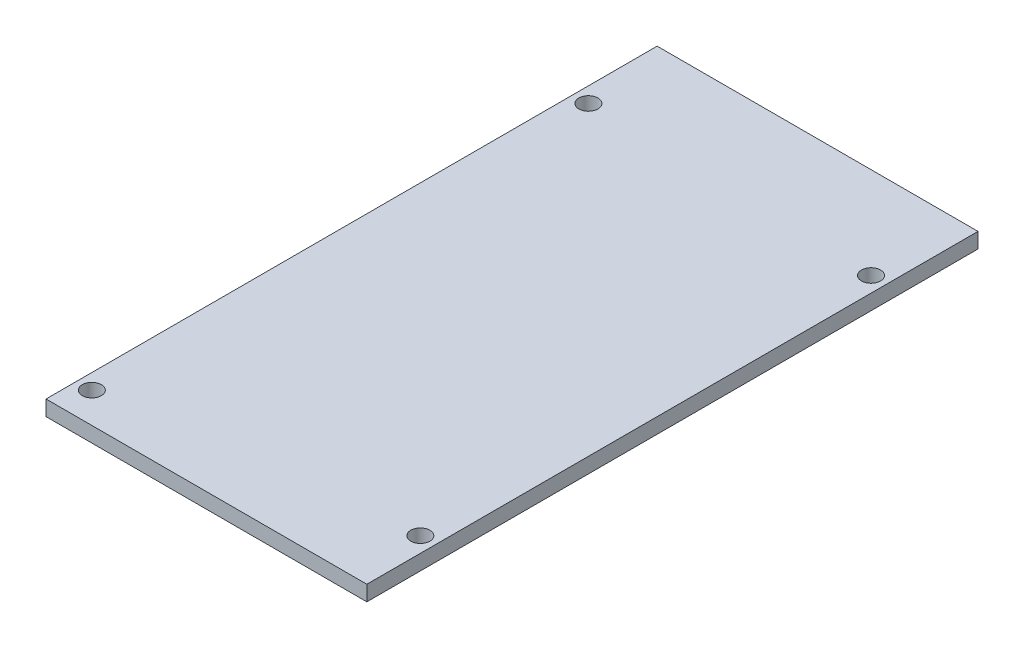
ISO-10303-21;
HEADER;
FILE_DESCRIPTION(('STEP AP214'),'2;1');
FILE_NAME('part.step','',(''),(''),'','','');
FILE_SCHEMA(('AUTOMOTIVE_DESIGN { 1 0 10303 214 1 1 1 1 }'));
ENDSEC;
DATA;
#1=APPLICATION_CONTEXT('core data for automotive mechanical design processes');
#2=APPLICATION_PROTOCOL_DEFINITION('international standard','automotive_design',2000,#1);
#3=PRODUCT_CONTEXT('',#1,'mechanical');
#4=PRODUCT('Part','Part','',(#3));
#5=PRODUCT_RELATED_PRODUCT_CATEGORY('part','',(#4));
#6=PRODUCT_DEFINITION_FORMATION('','',#4);
#7=PRODUCT_DEFINITION_CONTEXT('part definition',#1,'design');
#8=PRODUCT_DEFINITION('design','',#6,#7);
#9=PRODUCT_DEFINITION_SHAPE('','',#8);
#10=(LENGTH_UNIT() NAMED_UNIT(*) SI_UNIT(.MILLI.,.METRE.));
#11=(NAMED_UNIT(*) PLANE_ANGLE_UNIT() SI_UNIT($,.RADIAN.));
#12=(NAMED_UNIT(*) SI_UNIT($,.STERADIAN.) SOLID_ANGLE_UNIT());
#13=UNCERTAINTY_MEASURE_WITH_UNIT(LENGTH_MEASURE(1.E-05),#10,'distance_accuracy_value','');
#14=(GEOMETRIC_REPRESENTATION_CONTEXT(3) GLOBAL_UNCERTAINTY_ASSIGNED_CONTEXT((#13)) GLOBAL_UNIT_ASSIGNED_CONTEXT((#10,
#11,#12)) REPRESENTATION_CONTEXT('',''));
#15=CARTESIAN_POINT('',(0.,0.,0.));
#16=DIRECTION('',(0.,0.,1.));
#17=DIRECTION('',(1.,0.,0.));
#18=AXIS2_PLACEMENT_3D('',#15,#16,#17);
#19=CARTESIAN_POINT('',(0.,2.54,0.));
#20=DIRECTION('',(0.,-1.,0.));
#21=DIRECTION('',(0.,0.,-1.));
#22=AXIS2_PLACEMENT_3D('',#19,#20,#21);
#23=PLANE('',#22);
#24=DIRECTION('',(0.,0.,1.));
#25=VECTOR('',#24,1.);
#26=CARTESIAN_POINT('',(0.,2.54,0.));
#27=LINE('',#26,#25);
#28=CARTESIAN_POINT('',(0.,2.54,-101.6));
#29=VERTEX_POINT('',#28);
#30=CARTESIAN_POINT('',(0.,2.54,0.));
#31=VERTEX_POINT('',#30);
#32=EDGE_CURVE('E85',#29,#31,#27,.T.);
#33=ORIENTED_EDGE('',*,*,#32,.T.);
#34=DIRECTION('',(1.,0.,0.));
#35=VECTOR('',#34,1.);
#36=CARTESIAN_POINT('',(0.,2.54,0.));
#37=LINE('',#36,#35);
#38=CARTESIAN_POINT('',(53.34,2.54,0.));
#39=VERTEX_POINT('',#38);
#40=EDGE_CURVE('E80',#31,#39,#37,.T.);
#41=ORIENTED_EDGE('',*,*,#40,.T.);
#42=DIRECTION('',(0.,0.,-1.));
#43=VECTOR('',#42,1.);
#44=CARTESIAN_POINT('',(53.34,2.54,0.));
#45=LINE('',#44,#43);
#46=CARTESIAN_POINT('',(53.34,2.54,-101.6));
#47=VERTEX_POINT('',#46);
#48=EDGE_CURVE('E83',#39,#47,#45,.T.);
#49=ORIENTED_EDGE('',*,*,#48,.T.);
#50=DIRECTION('',(-1.,0.,0.));
#51=VECTOR('',#50,1.);
#52=CARTESIAN_POINT('',(0.,2.54,-101.6));
#53=LINE('',#52,#51);
#54=EDGE_CURVE('E50',#47,#29,#53,.T.);
#55=ORIENTED_EDGE('',*,*,#54,.T.);
#56=EDGE_LOOP('',(#33,#41,#49,#55));
#57=FACE_BOUND('',#56,.T.);
#58=CARTESIAN_POINT('',(50.8,2.54,-86.36));
#59=DIRECTION('',(0.,1.,0.));
#60=DIRECTION('',(0.,0.,1.));
#61=AXIS2_PLACEMENT_3D('',#58,#59,#60);
#62=CIRCLE('',#61,1.5875);
#63=CARTESIAN_POINT('',(50.8,2.54,-84.7725));
#64=VERTEX_POINT('',#63);
#65=EDGE_CURVE('E100',#64,#64,#62,.T.);
#66=ORIENTED_EDGE('',*,*,#65,.F.);
#67=EDGE_LOOP('',(#66));
#68=FACE_BOUND('',#67,.T.);
#69=CARTESIAN_POINT('',(2.54,2.54,-87.63));
#70=DIRECTION('',(0.,1.,0.));
#71=DIRECTION('',(0.,0.,1.));
#72=AXIS2_PLACEMENT_3D('',#69,#70,#71);
#73=CIRCLE('',#72,1.5875);
#74=CARTESIAN_POINT('',(2.54,2.54,-86.0425));
#75=VERTEX_POINT('',#74);
#76=EDGE_CURVE('E115',#75,#75,#73,.T.);
#77=ORIENTED_EDGE('',*,*,#76,.F.);
#78=EDGE_LOOP('',(#77));
#79=FACE_BOUND('',#78,.T.);
#80=CARTESIAN_POINT('',(2.54,2.54,-5.08));
#81=DIRECTION('',(0.,1.,0.));
#82=DIRECTION('',(0.,0.,1.));
#83=AXIS2_PLACEMENT_3D('',#80,#81,#82);
#84=CIRCLE('',#83,1.5875);
#85=CARTESIAN_POINT('',(2.54,2.54,-3.4925));
#86=VERTEX_POINT('',#85);
#87=EDGE_CURVE('E121',#86,#86,#84,.T.);
#88=ORIENTED_EDGE('',*,*,#87,.F.);
#89=EDGE_LOOP('',(#88));
#90=FACE_BOUND('',#89,.T.);
#91=CARTESIAN_POINT('',(50.8,2.54,-11.43));
#92=DIRECTION('',(0.,1.,0.));
#93=DIRECTION('',(0.,0.,1.));
#94=AXIS2_PLACEMENT_3D('',#91,#92,#93);
#95=CIRCLE('',#94,1.5875);
#96=CARTESIAN_POINT('',(50.8,2.54,-9.84250000000001));
#97=VERTEX_POINT('',#96);
#98=EDGE_CURVE('E127',#97,#97,#95,.T.);
#99=ORIENTED_EDGE('',*,*,#98,.F.);
#100=EDGE_LOOP('',(#99));
#101=FACE_BOUND('',#100,.T.);
#102=ADVANCED_FACE('F33',(#57,#68,#79,#90,#101),#23,.F.);
#103=CARTESIAN_POINT('',(0.,0.,0.));
#104=DIRECTION('',(0.,-1.,0.));
#105=DIRECTION('',(0.,0.,-1.));
#106=AXIS2_PLACEMENT_3D('',#103,#104,#105);
#107=PLANE('',#106);
#108=CARTESIAN_POINT('',(2.54,0.,-5.08));
#109=DIRECTION('',(0.,1.,0.));
#110=DIRECTION('',(0.,0.,1.));
#111=AXIS2_PLACEMENT_3D('',#108,#109,#110);
#112=CIRCLE('',#111,1.5875);
#113=CARTESIAN_POINT('',(2.54,0.,-3.4925));
#114=VERTEX_POINT('',#113);
#115=EDGE_CURVE('E124',#114,#114,#112,.T.);
#116=ORIENTED_EDGE('',*,*,#115,.T.);
#117=EDGE_LOOP('',(#116));
#118=FACE_BOUND('',#117,.T.);
#119=CARTESIAN_POINT('',(50.8,0.,-86.36));
#120=DIRECTION('',(0.,1.,0.));
#121=DIRECTION('',(0.,0.,1.));
#122=AXIS2_PLACEMENT_3D('',#119,#120,#121);
#123=CIRCLE('',#122,1.5875);
#124=CARTESIAN_POINT('',(50.8,0.,-84.7725));
#125=VERTEX_POINT('',#124);
#126=EDGE_CURVE('E112',#125,#125,#123,.T.);
#127=ORIENTED_EDGE('',*,*,#126,.T.);
#128=EDGE_LOOP('',(#127));
#129=FACE_BOUND('',#128,.T.);
#130=DIRECTION('',(0.,0.,1.));
#131=VECTOR('',#130,1.);
#132=CARTESIAN_POINT('',(0.,0.,0.));
#133=LINE('',#132,#131);
#134=CARTESIAN_POINT('',(0.,0.,-101.6));
#135=VERTEX_POINT('',#134);
#136=CARTESIAN_POINT('',(0.,0.,0.));
#137=VERTEX_POINT('',#136);
#138=EDGE_CURVE('E97',#135,#137,#133,.T.);
#139=ORIENTED_EDGE('',*,*,#138,.F.);
#140=DIRECTION('',(-1.,0.,0.));
#141=VECTOR('',#140,1.);
#142=CARTESIAN_POINT('',(0.,0.,-101.6));
#143=LINE('',#142,#141);
#144=CARTESIAN_POINT('',(53.34,0.,-101.6));
#145=VERTEX_POINT('',#144);
#146=EDGE_CURVE('E73',#145,#135,#143,.T.);
#147=ORIENTED_EDGE('',*,*,#146,.F.);
#148=DIRECTION('',(0.,0.,-1.));
#149=VECTOR('',#148,1.);
#150=CARTESIAN_POINT('',(53.34,0.,0.));
#151=LINE('',#150,#149);
#152=CARTESIAN_POINT('',(53.34,0.,0.));
#153=VERTEX_POINT('',#152);
#154=EDGE_CURVE('E67',#153,#145,#151,.T.);
#155=ORIENTED_EDGE('',*,*,#154,.F.);
#156=DIRECTION('',(1.,0.,0.));
#157=VECTOR('',#156,1.);
#158=CARTESIAN_POINT('',(0.,0.,0.));
#159=LINE('',#158,#157);
#160=EDGE_CURVE('E89',#137,#153,#159,.T.);
#161=ORIENTED_EDGE('',*,*,#160,.F.);
#162=EDGE_LOOP('',(#139,#147,#155,#161));
#163=FACE_BOUND('',#162,.T.);
#164=CARTESIAN_POINT('',(2.54,0.,-87.63));
#165=DIRECTION('',(0.,1.,0.));
#166=DIRECTION('',(0.,0.,1.));
#167=AXIS2_PLACEMENT_3D('',#164,#165,#166);
#168=CIRCLE('',#167,1.5875);
#169=CARTESIAN_POINT('',(2.54,0.,-86.0425));
#170=VERTEX_POINT('',#169);
#171=EDGE_CURVE('E118',#170,#170,#168,.T.);
#172=ORIENTED_EDGE('',*,*,#171,.T.);
#173=EDGE_LOOP('',(#172));
#174=FACE_BOUND('',#173,.T.);
#175=CARTESIAN_POINT('',(50.8,0.,-11.43));
#176=DIRECTION('',(0.,1.,0.));
#177=DIRECTION('',(0.,0.,1.));
#178=AXIS2_PLACEMENT_3D('',#175,#176,#177);
#179=CIRCLE('',#178,1.5875);
#180=CARTESIAN_POINT('',(50.8,0.,-9.84250000000001));
#181=VERTEX_POINT('',#180);
#182=EDGE_CURVE('E130',#181,#181,#179,.T.);
#183=ORIENTED_EDGE('',*,*,#182,.T.);
#184=EDGE_LOOP('',(#183));
#185=FACE_BOUND('',#184,.T.);
#186=ADVANCED_FACE('F108',(#118,#129,#163,#174,#185),#107,.T.);
#187=CARTESIAN_POINT('',(0.,2.54,0.));
#188=DIRECTION('',(1.,0.,0.));
#189=DIRECTION('',(0.,0.,-1.));
#190=AXIS2_PLACEMENT_3D('',#187,#188,#189);
#191=PLANE('',#190);
#192=ORIENTED_EDGE('',*,*,#138,.T.);
#193=DIRECTION('',(0.,-1.,0.));
#194=VECTOR('',#193,1.);
#195=CARTESIAN_POINT('',(0.,2.54,0.));
#196=LINE('',#195,#194);
#197=EDGE_CURVE('E11',#31,#137,#196,.T.);
#198=ORIENTED_EDGE('',*,*,#197,.F.);
#199=ORIENTED_EDGE('',*,*,#32,.F.);
#200=DIRECTION('',(0.,-1.,0.));
#201=VECTOR('',#200,1.);
#202=CARTESIAN_POINT('',(0.,2.54,-101.6));
#203=LINE('',#202,#201);
#204=EDGE_CURVE('E93',#29,#135,#203,.T.);
#205=ORIENTED_EDGE('',*,*,#204,.T.);
#206=EDGE_LOOP('',(#192,#198,#199,#205));
#207=FACE_BOUND('',#206,.T.);
#208=ADVANCED_FACE('F35',(#207),#191,.F.);
#209=CARTESIAN_POINT('',(0.,2.54,0.));
#210=DIRECTION('',(0.,0.,-1.));
#211=DIRECTION('',(-1.,0.,0.));
#212=AXIS2_PLACEMENT_3D('',#209,#210,#211);
#213=PLANE('',#212);
#214=ORIENTED_EDGE('',*,*,#160,.T.);
#215=DIRECTION('',(0.,-1.,0.));
#216=VECTOR('',#215,1.);
#217=CARTESIAN_POINT('',(53.34,2.54,0.));
#218=LINE('',#217,#216);
#219=EDGE_CURVE('E42',#39,#153,#218,.T.);
#220=ORIENTED_EDGE('',*,*,#219,.F.);
#221=ORIENTED_EDGE('',*,*,#40,.F.);
#222=ORIENTED_EDGE('',*,*,#197,.T.);
#223=EDGE_LOOP('',(#214,#220,#221,#222));
#224=FACE_BOUND('',#223,.T.);
#225=ADVANCED_FACE('F88',(#224),#213,.F.);
#226=CARTESIAN_POINT('',(53.34,2.54,0.));
#227=DIRECTION('',(-1.,0.,0.));
#228=DIRECTION('',(0.,0.,1.));
#229=AXIS2_PLACEMENT_3D('',#226,#227,#228);
#230=PLANE('',#229);
#231=ORIENTED_EDGE('',*,*,#154,.T.);
#232=DIRECTION('',(0.,-1.,0.));
#233=VECTOR('',#232,1.);
#234=CARTESIAN_POINT('',(53.34,2.54,-101.6));
#235=LINE('',#234,#233);
#236=EDGE_CURVE('E90',#47,#145,#235,.T.);
#237=ORIENTED_EDGE('',*,*,#236,.F.);
#238=ORIENTED_EDGE('',*,*,#48,.F.);
#239=ORIENTED_EDGE('',*,*,#219,.T.);
#240=EDGE_LOOP('',(#231,#237,#238,#239));
#241=FACE_BOUND('',#240,.T.);
#242=ADVANCED_FACE('F91',(#241),#230,.F.);
#243=CARTESIAN_POINT('',(0.,2.54,-101.6));
#244=DIRECTION('',(0.,0.,1.));
#245=DIRECTION('',(1.,0.,0.));
#246=AXIS2_PLACEMENT_3D('',#243,#244,#245);
#247=PLANE('',#246);
#248=ORIENTED_EDGE('',*,*,#146,.T.);
#249=ORIENTED_EDGE('',*,*,#204,.F.);
#250=ORIENTED_EDGE('',*,*,#54,.F.);
#251=ORIENTED_EDGE('',*,*,#236,.T.);
#252=EDGE_LOOP('',(#248,#249,#250,#251));
#253=FACE_BOUND('',#252,.T.);
#254=ADVANCED_FACE('F105',(#253),#247,.F.);
#255=CARTESIAN_POINT('',(50.8,2.54,-86.36));
#256=DIRECTION('',(0.,-1.,0.));
#257=DIRECTION('',(0.,0.,-1.));
#258=AXIS2_PLACEMENT_3D('',#255,#256,#257);
#259=CYLINDRICAL_SURFACE('',#258,1.5875);
#260=ORIENTED_EDGE('',*,*,#65,.T.);
#261=EDGE_LOOP('',(#260));
#262=FACE_BOUND('',#261,.T.);
#263=ORIENTED_EDGE('',*,*,#126,.F.);
#264=EDGE_LOOP('',(#263));
#265=FACE_BOUND('',#264,.T.);
#266=ADVANCED_FACE('F147',(#262,#265),#259,.F.);
#267=CARTESIAN_POINT('',(2.54,2.54,-87.63));
#268=DIRECTION('',(0.,-1.,0.));
#269=DIRECTION('',(0.,0.,-1.));
#270=AXIS2_PLACEMENT_3D('',#267,#268,#269);
#271=CYLINDRICAL_SURFACE('',#270,1.5875);
#272=ORIENTED_EDGE('',*,*,#76,.T.);
#273=EDGE_LOOP('',(#272));
#274=FACE_BOUND('',#273,.T.);
#275=ORIENTED_EDGE('',*,*,#171,.F.);
#276=EDGE_LOOP('',(#275));
#277=FACE_BOUND('',#276,.T.);
#278=ADVANCED_FACE('F193',(#274,#277),#271,.F.);
#279=CARTESIAN_POINT('',(2.54,2.54,-5.08));
#280=DIRECTION('',(0.,-1.,0.));
#281=DIRECTION('',(0.,0.,-1.));
#282=AXIS2_PLACEMENT_3D('',#279,#280,#281);
#283=CYLINDRICAL_SURFACE('',#282,1.5875);
#284=ORIENTED_EDGE('',*,*,#87,.T.);
#285=EDGE_LOOP('',(#284));
#286=FACE_BOUND('',#285,.T.);
#287=ORIENTED_EDGE('',*,*,#115,.F.);
#288=EDGE_LOOP('',(#287));
#289=FACE_BOUND('',#288,.T.);
#290=ADVANCED_FACE('F201',(#286,#289),#283,.F.);
#291=CARTESIAN_POINT('',(50.8,2.54,-11.43));
#292=DIRECTION('',(0.,-1.,0.));
#293=DIRECTION('',(0.,0.,-1.));
#294=AXIS2_PLACEMENT_3D('',#291,#292,#293);
#295=CYLINDRICAL_SURFACE('',#294,1.5875);
#296=ORIENTED_EDGE('',*,*,#98,.T.);
#297=EDGE_LOOP('',(#296));
#298=FACE_BOUND('',#297,.T.);
#299=ORIENTED_EDGE('',*,*,#182,.F.);
#300=EDGE_LOOP('',(#299));
#301=FACE_BOUND('',#300,.T.);
#302=ADVANCED_FACE('F136',(#298,#301),#295,.F.);
#303=CLOSED_SHELL('',(#102,#186,#208,#225,#242,#254,#266,#278,#290,#302));
#304=MANIFOLD_SOLID_BREP('B2',#303);
#305=ADVANCED_BREP_SHAPE_REPRESENTATION('',(#18,#304),#14);
#306=SHAPE_DEFINITION_REPRESENTATION(#9,#305);
ENDSEC;
END-ISO-10303-21;
